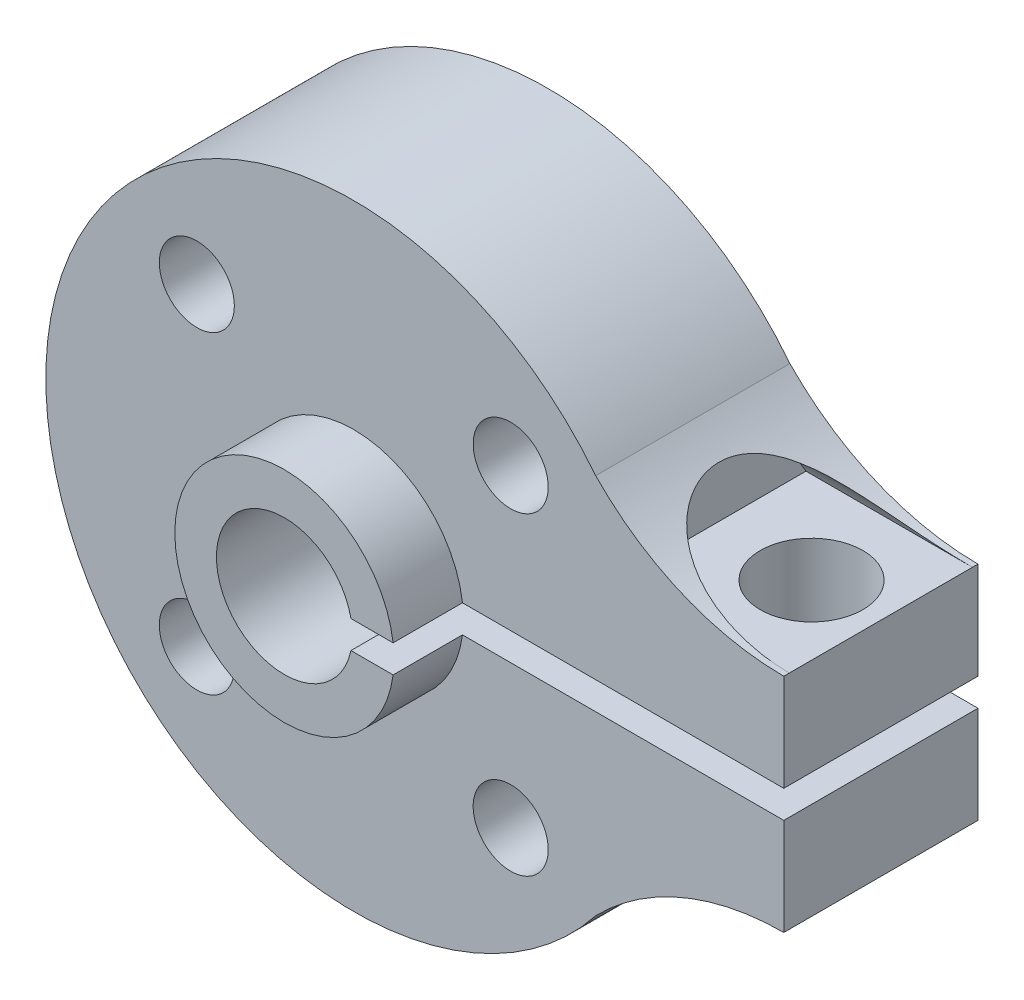
ISO-10303-21;
HEADER;
FILE_DESCRIPTION(('STEP AP214'),'2;1');
FILE_NAME('part.step','',(''),(''),'','','');
FILE_SCHEMA(('AUTOMOTIVE_DESIGN { 1 0 10303 214 1 1 1 1 }'));
ENDSEC;
DATA;
#1=APPLICATION_CONTEXT('core data for automotive mechanical design processes');
#2=APPLICATION_PROTOCOL_DEFINITION('international standard','automotive_design',2000,#1);
#3=PRODUCT_CONTEXT('',#1,'mechanical');
#4=PRODUCT('Part','Part','',(#3));
#5=PRODUCT_RELATED_PRODUCT_CATEGORY('part','',(#4));
#6=PRODUCT_DEFINITION_FORMATION('','',#4);
#7=PRODUCT_DEFINITION_CONTEXT('part definition',#1,'design');
#8=PRODUCT_DEFINITION('design','',#6,#7);
#9=PRODUCT_DEFINITION_SHAPE('','',#8);
#10=(LENGTH_UNIT() NAMED_UNIT(*) SI_UNIT(.MILLI.,.METRE.));
#11=(NAMED_UNIT(*) PLANE_ANGLE_UNIT() SI_UNIT($,.RADIAN.));
#12=(NAMED_UNIT(*) SI_UNIT($,.STERADIAN.) SOLID_ANGLE_UNIT());
#13=UNCERTAINTY_MEASURE_WITH_UNIT(LENGTH_MEASURE(1.E-05),#10,'distance_accuracy_value','');
#14=(GEOMETRIC_REPRESENTATION_CONTEXT(3) GLOBAL_UNCERTAINTY_ASSIGNED_CONTEXT((#13)) GLOBAL_UNIT_ASSIGNED_CONTEXT((#10,
#11,#12)) REPRESENTATION_CONTEXT('',''));
#15=CARTESIAN_POINT('',(0.,0.,0.));
#16=DIRECTION('',(0.,0.,1.));
#17=DIRECTION('',(1.,0.,0.));
#18=AXIS2_PLACEMENT_3D('',#15,#16,#17);
#19=CARTESIAN_POINT('',(9.5,2.30819429931814,-3.5));
#20=DIRECTION('',(-1.,0.,0.));
#21=DIRECTION('',(0.,0.,1.));
#22=AXIS2_PLACEMENT_3D('',#19,#20,#21);
#23=PLANE('',#22);
#24=CARTESIAN_POINT('',(9.5,2.30819429931814,-3.5));
#25=DIRECTION('',(1.,0.,0.));
#26=DIRECTION('',(0.,0.,-1.));
#27=AXIS2_PLACEMENT_3D('',#24,#25,#26);
#28=CIRCLE('',#27,3.70839675990308);
#29=CARTESIAN_POINT('',(9.5,4.,-6.8));
#30=VERTEX_POINT('',#29);
#31=CARTESIAN_POINT('',(9.5,4.,-0.2));
#32=VERTEX_POINT('',#31);
#33=EDGE_CURVE('E94',#30,#32,#28,.T.);
#34=ORIENTED_EDGE('',*,*,#33,.T.);
#35=DIRECTION('',(0.,0.,-1.));
#36=VECTOR('',#35,1.);
#37=CARTESIAN_POINT('',(9.5,4.,-0.2));
#38=LINE('',#37,#36);
#39=EDGE_CURVE('E91',#32,#30,#38,.T.);
#40=ORIENTED_EDGE('',*,*,#39,.T.);
#41=EDGE_LOOP('',(#34,#40));
#42=FACE_BOUND('',#41,.T.);
#43=ADVANCED_FACE('F15',(#42),#23,.F.);
#44=CARTESIAN_POINT('',(13.,11.1,-3.5));
#45=DIRECTION('',(0.,-1.,0.));
#46=DIRECTION('',(0.,0.,-1.));
#47=AXIS2_PLACEMENT_3D('',#44,#45,#46);
#48=CYLINDRICAL_SURFACE('',#47,1.85);
#49=CARTESIAN_POINT('',(13.,0.5,-3.5));
#50=DIRECTION('',(0.,-1.,0.));
#51=DIRECTION('',(0.,0.,-1.));
#52=AXIS2_PLACEMENT_3D('',#49,#50,#51);
#53=CIRCLE('',#52,1.85);
#54=CARTESIAN_POINT('',(13.,0.5,-5.35));
#55=VERTEX_POINT('',#54);
#56=EDGE_CURVE('E273',#55,#55,#53,.F.);
#57=ORIENTED_EDGE('',*,*,#56,.F.);
#58=EDGE_LOOP('',(#57));
#59=FACE_BOUND('',#58,.T.);
#60=CARTESIAN_POINT('',(13.,4.,-3.5));
#61=DIRECTION('',(0.,-1.,0.));
#62=DIRECTION('',(0.,0.,-1.));
#63=AXIS2_PLACEMENT_3D('',#60,#61,#62);
#64=CIRCLE('',#63,1.85);
#65=CARTESIAN_POINT('',(13.,4.,-5.35));
#66=VERTEX_POINT('',#65);
#67=EDGE_CURVE('E18',#66,#66,#64,.F.);
#68=ORIENTED_EDGE('',*,*,#67,.T.);
#69=EDGE_LOOP('',(#68));
#70=FACE_BOUND('',#69,.T.);
#71=ADVANCED_FACE('F205',(#59,#70),#48,.F.);
#72=CARTESIAN_POINT('',(9.5,4.,-0.2));
#73=DIRECTION('',(0.,-1.,0.));
#74=DIRECTION('',(0.,0.,-1.));
#75=AXIS2_PLACEMENT_3D('',#72,#73,#74);
#76=PLANE('',#75);
#77=ORIENTED_EDGE('',*,*,#67,.F.);
#78=EDGE_LOOP('',(#77));
#79=FACE_BOUND('',#78,.T.);
#80=ORIENTED_EDGE('',*,*,#39,.F.);
#81=DIRECTION('',(1.,0.,0.));
#82=VECTOR('',#81,1.);
#83=CARTESIAN_POINT('',(9.5,4.,-0.200000000000001));
#84=LINE('',#83,#82);
#85=CARTESIAN_POINT('',(15.5,4.,-0.2));
#86=VERTEX_POINT('',#85);
#87=EDGE_CURVE('E98',#32,#86,#84,.T.);
#88=ORIENTED_EDGE('',*,*,#87,.T.);
#89=DIRECTION('',(0.,0.,-1.));
#90=VECTOR('',#89,1.);
#91=CARTESIAN_POINT('',(15.5,4.,-7.));
#92=LINE('',#91,#90);
#93=CARTESIAN_POINT('',(15.5,4.,-6.8));
#94=VERTEX_POINT('',#93);
#95=EDGE_CURVE('E114',#94,#86,#92,.F.);
#96=ORIENTED_EDGE('',*,*,#95,.F.);
#97=DIRECTION('',(1.,0.,0.));
#98=VECTOR('',#97,1.);
#99=CARTESIAN_POINT('',(9.5,4.,-6.8));
#100=LINE('',#99,#98);
#101=EDGE_CURVE('E99',#94,#30,#100,.F.);
#102=ORIENTED_EDGE('',*,*,#101,.T.);
#103=EDGE_LOOP('',(#80,#88,#96,#102));
#104=FACE_BOUND('',#103,.T.);
#105=ADVANCED_FACE('F101',(#79,#104),#76,.F.);
#106=CARTESIAN_POINT('',(0.,0.,2.5));
#107=DIRECTION('',(0.,0.,1.));
#108=DIRECTION('',(1.,0.,0.));
#109=AXIS2_PLACEMENT_3D('',#106,#107,#108);
#110=PLANE('',#109);
#111=DIRECTION('',(1.,0.,0.));
#112=VECTOR('',#111,1.);
#113=CARTESIAN_POINT('',(0.,-0.5,2.5));
#114=LINE('',#113,#112);
#115=CARTESIAN_POINT('',(2.39843699104229,-0.5,2.5));
#116=VERTEX_POINT('',#115);
#117=CARTESIAN_POINT('',(3.91822663969301,-0.5,2.5));
#118=VERTEX_POINT('',#117);
#119=EDGE_CURVE('E120',#116,#118,#114,.T.);
#120=ORIENTED_EDGE('',*,*,#119,.F.);
#121=CARTESIAN_POINT('',(0.,0.,2.5));
#122=DIRECTION('',(0.,0.,1.));
#123=DIRECTION('',(1.,0.,0.));
#124=AXIS2_PLACEMENT_3D('',#121,#122,#123);
#125=CIRCLE('',#124,2.45);
#126=CARTESIAN_POINT('',(2.39843699104229,0.5,2.5));
#127=VERTEX_POINT('',#126);
#128=EDGE_CURVE('E108',#116,#127,#125,.F.);
#129=ORIENTED_EDGE('',*,*,#128,.T.);
#130=DIRECTION('',(1.,0.,0.));
#131=VECTOR('',#130,1.);
#132=CARTESIAN_POINT('',(0.,0.5,2.5));
#133=LINE('',#132,#131);
#134=CARTESIAN_POINT('',(3.91822663969301,0.499999999999999,2.5));
#135=VERTEX_POINT('',#134);
#136=EDGE_CURVE('E110',#135,#127,#133,.F.);
#137=ORIENTED_EDGE('',*,*,#136,.F.);
#138=CARTESIAN_POINT('',(0.,0.,2.5));
#139=DIRECTION('',(0.,0.,-1.));
#140=DIRECTION('',(-1.,0.,0.));
#141=AXIS2_PLACEMENT_3D('',#138,#139,#140);
#142=CIRCLE('',#141,3.95);
#143=EDGE_CURVE('E194',#118,#135,#142,.T.);
#144=ORIENTED_EDGE('',*,*,#143,.F.);
#145=EDGE_LOOP('',(#120,#129,#137,#144));
#146=FACE_BOUND('',#145,.T.);
#147=ADVANCED_FACE('F200',(#146),#110,.T.);
#148=CARTESIAN_POINT('',(9.5,2.30819429931814,-3.5));
#149=DIRECTION('',(1.,0.,0.));
#150=DIRECTION('',(0.,0.,-1.));
#151=AXIS2_PLACEMENT_3D('',#148,#149,#150);
#152=CYLINDRICAL_SURFACE('',#151,3.70839675990308);
#153=ORIENTED_EDGE('',*,*,#33,.F.);
#154=ORIENTED_EDGE('',*,*,#101,.F.);
#155=CARTESIAN_POINT('',(15.5,4.,-6.8));
#156=CARTESIAN_POINT('',(15.3854172561424,3.99999807144267,-6.79999040357477));
#157=CARTESIAN_POINT('',(15.2708345037204,4.00208452565123,-6.79893104370746));
#158=CARTESIAN_POINT('',(15.0418545088414,4.01042007363528,-6.79464326988381));
#159=CARTESIAN_POINT('',(14.927457277829,4.01666941510603,-6.79141472685915));
#160=CARTESIAN_POINT('',(14.6988557808845,4.03333058412202,-6.78271174393225));
#161=CARTESIAN_POINT('',(14.5846521614541,4.04374938302887,-6.7772335421817));
#162=CARTESIAN_POINT('',(14.3568466591295,4.06871528645661,-6.76388854983141));
#163=CARTESIAN_POINT('',(14.2432447653972,4.08326231636212,-6.75602180240309));
#164=CARTESIAN_POINT('',(13.9012476272513,4.13338726905936,-6.72837211210196));
#165=CARTESIAN_POINT('',(13.6740472792935,4.17527511633216,-6.70462249151998));
#166=CARTESIAN_POINT('',(13.2250868669362,4.2751032631053,-6.6443418692978));
#167=CARTESIAN_POINT('',(13.0033221022707,4.33302911979295,-6.60782235966463));
#168=CARTESIAN_POINT('',(12.6529356022981,4.43813091397701,-6.53609331014185));
#169=CARTESIAN_POINT('',(12.5218503492442,4.48063203510911,-6.50597227338733));
#170=CARTESIAN_POINT('',(12.2632290057728,4.57071030493075,-6.43877426680966));
#171=CARTESIAN_POINT('',(12.1356928962284,4.61828742625827,-6.40169733448122));
#172=CARTESIAN_POINT('',(11.8854487831583,4.71775519771825,-6.31963922664295));
#173=CARTESIAN_POINT('',(11.7627254940675,4.76963022726073,-6.27468606548902));
#174=CARTESIAN_POINT('',(11.5227135874722,4.87697578128223,-6.1756110759212));
#175=CARTESIAN_POINT('',(11.4054232772453,4.93244517278819,-6.12149212804412));
#176=CARTESIAN_POINT('',(11.1256985684173,5.071639846092,-5.97585734382104));
#177=CARTESIAN_POINT('',(10.9669053561282,5.15677415238713,-5.87851068639103));
#178=CARTESIAN_POINT('',(10.6682954041506,5.32718244619845,-5.65805983866077));
#179=CARTESIAN_POINT('',(10.5284532138078,5.41245608755683,-5.53499076935316));
#180=CARTESIAN_POINT('',(10.3029570714845,5.55700216381973,-5.29236628463612));
#181=CARTESIAN_POINT('',(10.2122236670459,5.61776209979494,-5.17843958840174));
#182=CARTESIAN_POINT('',(10.0487893069114,5.73065496290752,-4.93421505548655));
#183=CARTESIAN_POINT('',(9.9760826861075,5.78279059860416,-4.80392238142989));
#184=CARTESIAN_POINT('',(9.88271984953562,5.85123562170811,-4.5974617800788));
#185=CARTESIAN_POINT('',(9.85411340712691,5.87250463892867,-4.52642625450107));
#186=CARTESIAN_POINT('',(9.80265428832829,5.91113202664648,-4.3812899914558));
#187=CARTESIAN_POINT('',(9.77979860146107,5.92849244276424,-4.30719088150624));
#188=CARTESIAN_POINT('',(9.74015073098036,5.95881984828703,-4.15653545136116));
#189=CARTESIAN_POINT('',(9.72335620443466,5.97178853518842,-4.07998009311207));
#190=CARTESIAN_POINT('',(9.69604787686337,5.99297113329585,-3.92514115874213));
#191=CARTESIAN_POINT('',(9.68553304823361,6.00118582243503,-3.84685786755398));
#192=CARTESIAN_POINT('',(9.66571269419053,6.01668686364119,-3.63272797682053));
#193=CARTESIAN_POINT('',(9.66268060711463,6.01908388455583,-3.49585578487429));
#194=CARTESIAN_POINT('',(9.67580092483512,6.00879517138107,-3.22372435833211));
#195=CARTESIAN_POINT('',(9.69194697787806,5.99611443100812,-3.08846460468292));
#196=CARTESIAN_POINT('',(9.74140060570357,5.95784036040203,-2.83033541035476));
#197=CARTESIAN_POINT('',(9.77379479620414,5.93293564756355,-2.70718559216987));
#198=CARTESIAN_POINT('',(9.854030384613,5.87246966733322,-2.46884489684084));
#199=CARTESIAN_POINT('',(9.90187372262156,5.83690706156605,-2.35365502151121));
#200=CARTESIAN_POINT('',(10.0153708669368,5.75467131035558,-2.12530832541396));
#201=CARTESIAN_POINT('',(10.0820564209863,5.70738398145104,-2.01289063057051));
#202=CARTESIAN_POINT('',(10.2292221810183,5.6064316192375,-1.80068540326613));
#203=CARTESIAN_POINT('',(10.3097094543092,5.55276332282889,-1.7009043872791));
#204=CARTESIAN_POINT('',(10.4617575283369,5.45514545743436,-1.53638994983406));
#205=CARTESIAN_POINT('',(10.5309064551307,5.41191057285586,-1.46895760039825));
#206=CARTESIAN_POINT('',(10.6750840937525,5.32452300554102,-1.34130785397804));
#207=CARTESIAN_POINT('',(10.7501152592551,5.28036994550684,-1.28109349462556));
#208=CARTESIAN_POINT('',(10.9053325302043,5.19204954805674,-1.16745307872577));
#209=CARTESIAN_POINT('',(10.9855265073713,5.14788229613572,-1.11403777634628));
#210=CARTESIAN_POINT('',(11.1502648300482,5.06037063385561,-1.01360351201137));
#211=CARTESIAN_POINT('',(11.2348105538086,5.01702649020899,-0.966586593895371));
#212=CARTESIAN_POINT('',(11.4491601443267,4.911317642686,-0.857234031716232));
#213=CARTESIAN_POINT('',(11.5811855099708,4.84982407399195,-0.79839724994698));
#214=CARTESIAN_POINT('',(11.8517008005558,4.73158833415568,-0.69185096918447));
#215=CARTESIAN_POINT('',(11.9901938582407,4.6748485035395,-0.644146931053227));
#216=CARTESIAN_POINT('',(12.2727994055428,4.56698866176261,-0.558090419684882));
#217=CARTESIAN_POINT('',(12.4169310013095,4.51589049754442,-0.519773645044784));
#218=CARTESIAN_POINT('',(12.7092115298442,4.42029218777549,-0.451279086548752));
#219=CARTESIAN_POINT('',(12.8573601583134,4.37579154409096,-0.421100688078475));
#220=CARTESIAN_POINT('',(13.2088503671494,4.27964035910125,-0.358348077632845));
#221=CARTESIAN_POINT('',(13.4134887431049,4.23087541572759,-0.328582781999699));
#222=CARTESIAN_POINT('',(13.8267983828836,4.14695137700669,-0.279202513194161));
#223=CARTESIAN_POINT('',(14.0354716910433,4.11179937907042,-0.25959283308484));
#224=CARTESIAN_POINT('',(14.4530137871774,4.05585754801037,-0.229084764078336));
#225=CARTESIAN_POINT('',(14.6618549020662,4.0349132104665,-0.218092452133774));
#226=CARTESIAN_POINT('',(14.9758505914231,4.01396785329268,-0.207190475715983));
#227=CARTESIAN_POINT('',(15.0805924216449,4.00873126349007,-0.204487528312588));
#228=CARTESIAN_POINT('',(15.2902194458754,4.00174728093228,-0.200895003143422));
#229=CARTESIAN_POINT('',(15.3951046341522,3.99999975253345,-0.200005354882307));
#230=CARTESIAN_POINT('',(15.5,4.,-0.199999999999999));
#231=B_SPLINE_CURVE_WITH_KNOTS('',3,(#155,#156,#157,#158,#159,#160,#161,#162,#163,#164,#165,
#166,#167,#168,#169,#170,#171,#172,#173,#174,#175,#176,#177,#178,#179,#180,#181,#182,#183,#184,
#185,#186,#187,#188,#189,#190,#191,#192,#193,#194,#195,#196,#197,#198,#199,#200,#201,#202,#203,
#204,#205,#206,#207,#208,#209,#210,#211,#212,#213,#214,#215,#216,#217,#218,#219,#220,#221,#222,
#223,#224,#225,#226,#227,#228,#229,#230),.UNSPECIFIED.,.F.,.F.,(4,2,2,2,2,2,2,2,2,2,2,2,2,2,2,2,
2,2,2,2,2,2,2,2,2,2,2,2,2,2,2,2,2,2,2,2,2,4),(0.,0.34372397184354,0.687468397378405,
1.03178998346891,1.37610534654197,2.07189509147166,2.76706027899654,3.18996821448662,
3.61287387042043,4.03430477997364,4.45560349113384,5.06790502421624,5.67937592856169,
6.15105760704357,6.62259086613705,6.86072027072559,7.09872475577784,7.33663714177354,
7.57451058532365,7.98295112010661,8.39125641808701,8.77882172170534,9.16643571462257,
9.58186622266928,9.99751009479544,10.3145531519377,10.6317291690793,10.9494007936139,
11.2671736551728,11.7376814003852,12.2084194574227,12.6809208132693,13.1533864755719,
13.7899635271709,14.4268720269306,15.0567382504914,15.3713976456646,15.6860448076409),.UNSPECIFIED.);
#232=EDGE_CURVE('E106',#94,#86,#231,.T.);
#233=ORIENTED_EDGE('',*,*,#232,.T.);
#234=ORIENTED_EDGE('',*,*,#87,.F.);
#235=EDGE_LOOP('',(#153,#154,#233,#234));
#236=FACE_BOUND('',#235,.T.);
#237=ADVANCED_FACE('F104',(#236),#152,.F.);
#238=CARTESIAN_POINT('',(0.,0.,-7.));
#239=DIRECTION('',(0.,0.,1.));
#240=DIRECTION('',(1.,0.,0.));
#241=AXIS2_PLACEMENT_3D('',#238,#239,#240);
#242=CYLINDRICAL_SURFACE('',#241,2.45);
#243=DIRECTION('',(0.,0.,-1.));
#244=VECTOR('',#243,1.);
#245=CARTESIAN_POINT('',(2.39843699104229,0.5,-7.));
#246=LINE('',#245,#244);
#247=CARTESIAN_POINT('',(2.39843699104229,0.5,-7.));
#248=VERTEX_POINT('',#247);
#249=EDGE_CURVE('E119',#127,#248,#246,.T.);
#250=ORIENTED_EDGE('',*,*,#249,.F.);
#251=ORIENTED_EDGE('',*,*,#128,.F.);
#252=DIRECTION('',(0.,0.,1.));
#253=VECTOR('',#252,1.);
#254=CARTESIAN_POINT('',(2.39843699104229,-0.5,-7.));
#255=LINE('',#254,#253);
#256=CARTESIAN_POINT('',(2.39843699104229,-0.499999999999999,-7.));
#257=VERTEX_POINT('',#256);
#258=EDGE_CURVE('E264',#257,#116,#255,.T.);
#259=ORIENTED_EDGE('',*,*,#258,.F.);
#260=CARTESIAN_POINT('',(0.,0.,-7.));
#261=DIRECTION('',(0.,0.,1.));
#262=DIRECTION('',(1.,0.,0.));
#263=AXIS2_PLACEMENT_3D('',#260,#261,#262);
#264=CIRCLE('',#263,2.45);
#265=EDGE_CURVE('E235',#257,#248,#264,.F.);
#266=ORIENTED_EDGE('',*,*,#265,.T.);
#267=EDGE_LOOP('',(#250,#251,#259,#266));
#268=FACE_BOUND('',#267,.T.);
#269=ADVANCED_FACE('F199',(#268),#242,.F.);
#270=CARTESIAN_POINT('',(13.,-0.5,-3.5));
#271=DIRECTION('',(0.,1.,0.));
#272=DIRECTION('',(0.,0.,1.));
#273=AXIS2_PLACEMENT_3D('',#270,#271,#272);
#274=CYLINDRICAL_SURFACE('',#273,1.35254999999999);
#275=CARTESIAN_POINT('',(13.,-0.499999999999999,-3.5));
#276=DIRECTION('',(0.,1.,0.));
#277=DIRECTION('',(0.,0.,1.));
#278=AXIS2_PLACEMENT_3D('',#275,#276,#277);
#279=CIRCLE('',#278,1.35254999999999);
#280=CARTESIAN_POINT('',(13.,-0.499999999999999,-2.14745000000001));
#281=VERTEX_POINT('',#280);
#282=EDGE_CURVE('E261',#281,#281,#279,.F.);
#283=ORIENTED_EDGE('',*,*,#282,.F.);
#284=EDGE_LOOP('',(#283));
#285=FACE_BOUND('',#284,.T.);
#286=CARTESIAN_POINT('',(13.,-4.33677503027378,-4.85254999999999));
#287=CARTESIAN_POINT('',(13.0756244028838,-4.31602504709523,-4.85254696301458));
#288=CARTESIAN_POINT('',(13.1516051765923,-4.29619794160846,-4.84618518657547));
#289=CARTESIAN_POINT('',(13.3020765407953,-4.25889500859744,-4.82059919768668));
#290=CARTESIAN_POINT('',(13.3765641738948,-4.24142351727094,-4.80135164331774));
#291=CARTESIAN_POINT('',(13.5217637685789,-4.20913412886103,-4.75023079003071));
#292=CARTESIAN_POINT('',(13.5924733817324,-4.19431786911497,-4.71834973936002));
#293=CARTESIAN_POINT('',(13.7277596656429,-4.16745643974484,-4.64269890734088));
#294=CARTESIAN_POINT('',(13.7923392997966,-4.1554099271032,-4.59893491043957));
#295=CARTESIAN_POINT('',(13.9118574259715,-4.13424678145695,-4.50184656621174));
#296=CARTESIAN_POINT('',(13.9669860117244,-4.12506823827676,-4.44876963540917));
#297=CARTESIAN_POINT('',(14.0676498921143,-4.10907125650646,-4.33387523915693));
#298=CARTESIAN_POINT('',(14.1131851956245,-4.10225281573338,-4.27205778179183));
#299=CARTESIAN_POINT('',(14.1926395751803,-4.09080862149922,-4.14241714608313));
#300=CARTESIAN_POINT('',(14.2267166066267,-4.08615268320466,-4.07469336223897));
#301=CARTESIAN_POINT('',(14.2831141086079,-4.07865420429123,-3.93442297936375));
#302=CARTESIAN_POINT('',(14.3054349430252,-4.0758116075445,-3.86187652968406));
#303=CARTESIAN_POINT('',(14.3376050448136,-4.07176693950703,-3.71423602346031));
#304=CARTESIAN_POINT('',(14.3474884948816,-4.07056037107229,-3.63914953451878));
#305=CARTESIAN_POINT('',(14.3546041554255,-4.06968846686251,-3.48837034297547));
#306=CARTESIAN_POINT('',(14.3518363622054,-4.07002313153772,-3.4126776401966));
#307=CARTESIAN_POINT('',(14.3337300101086,-4.07225794680072,-3.2628238698283));
#308=CARTESIAN_POINT('',(14.3183897145974,-4.07415831365847,-3.18866301528333));
#309=CARTESIAN_POINT('',(14.275592583415,-4.07965302497061,-3.04398970505836));
#310=CARTESIAN_POINT('',(14.2481357416078,-4.08324737028286,-2.97347725122596));
#311=CARTESIAN_POINT('',(14.1819346991144,-4.09233643795686,-2.83811050411693));
#312=CARTESIAN_POINT('',(14.143191881575,-4.09783092746286,-2.77325551875707));
#313=CARTESIAN_POINT('',(14.055599848678,-4.11096230824967,-2.65102847349719));
#314=CARTESIAN_POINT('',(14.0067515991758,-4.11859899480871,-2.59365569931734));
#315=CARTESIAN_POINT('',(13.9004049995365,-4.13624474947462,-2.48792835988961));
#316=CARTESIAN_POINT('',(13.8429000084126,-4.14625564236738,-2.43958078263145));
#317=CARTESIAN_POINT('',(13.721005850003,-4.16879867343351,-2.35321182421282));
#318=CARTESIAN_POINT('',(13.6566138825357,-4.18133183897984,-2.31519466572012));
#319=CARTESIAN_POINT('',(13.5222945181374,-4.20906311856514,-2.25010996413787));
#320=CARTESIAN_POINT('',(13.4523209297325,-4.22428509040084,-2.2231482972393));
#321=CARTESIAN_POINT('',(13.3095095255519,-4.25715750890201,-2.18124379642085));
#322=CARTESIAN_POINT('',(13.2366767221063,-4.27480383041942,-2.16628083566389));
#323=CARTESIAN_POINT('',(13.1362754772266,-4.30042912848765,-2.15405282071968));
#324=CARTESIAN_POINT('',(13.1090319345304,-4.3075125176695,-2.15157527392268));
#325=CARTESIAN_POINT('',(13.0545182692149,-4.32194677508647,-2.14827337089699));
#326=CARTESIAN_POINT('',(13.02724814901,-4.32929762089377,-2.14744887637396));
#327=CARTESIAN_POINT('',(12.9204851487771,-4.35859541499665,-2.14745327893679));
#328=CARTESIAN_POINT('',(12.8411573985793,-4.38149358243874,-2.1544873089395));
#329=CARTESIAN_POINT('',(12.6852233828783,-4.42868477443356,-2.18219691227583));
#330=CARTESIAN_POINT('',(12.6086238047205,-4.45298088948822,-2.20290386048637));
#331=CARTESIAN_POINT('',(12.4604238136452,-4.50197644860191,-2.25723517881549));
#332=CARTESIAN_POINT('',(12.3888159156169,-4.52667521711848,-2.2908396940311));
#333=CARTESIAN_POINT('',(12.2523975563339,-4.57542712001505,-2.37008673277669));
#334=CARTESIAN_POINT('',(12.1875844716815,-4.59948050088293,-2.41572458627591));
#335=CARTESIAN_POINT('',(12.066092706108,-4.64591476415353,-2.51838022839361));
#336=CARTESIAN_POINT('',(12.009475929731,-4.66828236277703,-2.57547755939347));
#337=CARTESIAN_POINT('',(11.9067943489346,-4.70980484353352,-2.69951911881265));
#338=CARTESIAN_POINT('',(11.8607277374493,-4.72896027570589,-2.76646165768281));
#339=CARTESIAN_POINT('',(11.7828595230148,-4.76188242697211,-2.9050429611292));
#340=CARTESIAN_POINT('',(11.750484358307,-4.77586185860483,-2.97630771465424));
#341=CARTESIAN_POINT('',(11.6983800807687,-4.79857595621327,-3.1240960569208));
#342=CARTESIAN_POINT('',(11.6786422846566,-4.80731422319207,-3.20061599464913));
#343=CARTESIAN_POINT('',(11.6538330569858,-4.81833124512195,-3.35003064716998));
#344=CARTESIAN_POINT('',(11.6477021624014,-4.82107632293046,-3.42271620206813));
#345=CARTESIAN_POINT('',(11.6472133398873,-4.82129439766836,-3.56812561197517));
#346=CARTESIAN_POINT('',(11.6528522686444,-4.81876880221256,-3.64084945157383));
#347=CARTESIAN_POINT('',(11.6751488910641,-4.80886387933526,-3.78104776644719));
#348=CARTESIAN_POINT('',(11.6913298512417,-4.80169462626298,-3.84861412241824));
#349=CARTESIAN_POINT('',(11.7335930127345,-4.78320045366593,-3.97996523649169));
#350=CARTESIAN_POINT('',(11.759676513263,-4.77187498885273,-4.04374949711308));
#351=CARTESIAN_POINT('',(11.8218442232517,-4.74533254981107,-4.16807937030676));
#352=CARTESIAN_POINT('',(11.858229553766,-4.72999967809933,-4.22844909361418));
#353=CARTESIAN_POINT('',(11.9394434654755,-4.69651550044696,-4.34232201689261));
#354=CARTESIAN_POINT('',(11.9842740193636,-4.67836353617775,-4.3958236076388));
#355=CARTESIAN_POINT('',(12.0848855503532,-4.63866994229757,-4.49876050491149));
#356=CARTESIAN_POINT('',(12.141240369494,-4.61697546004347,-4.54757611986351));
#357=CARTESIAN_POINT('',(12.2609023319215,-4.5723847604621,-4.63517857764382));
#358=CARTESIAN_POINT('',(12.32421517611,-4.54948756585883,-4.67395710821763));
#359=CARTESIAN_POINT('',(12.4604063804737,-4.5020136995674,-4.74274375877201));
#360=CARTESIAN_POINT('',(12.5336359351567,-4.47742199081221,-4.7720466671701));
#361=CARTESIAN_POINT('',(12.6841928072668,-4.42903145395725,-4.81750429880625));
#362=CARTESIAN_POINT('',(12.7615110459203,-4.40523104573618,-4.83368694878717));
#363=CARTESIAN_POINT('',(12.8663091631003,-4.37447621185725,-4.84619256481914));
#364=CARTESIAN_POINT('',(12.8929448670467,-4.36678698824123,-4.84857208497996));
#365=CARTESIAN_POINT('',(12.9463720796099,-4.35161810246073,-4.85175140794023));
#366=CARTESIAN_POINT('',(12.973163601156,-4.34413845799489,-4.85255107771762));
#367=CARTESIAN_POINT('',(13.,-4.33677503027378,-4.85254999999999));
#368=B_SPLINE_CURVE_WITH_KNOTS('',3,(#286,#287,#288,#289,#290,#291,#292,#293,#294,#295,#296,
#297,#298,#299,#300,#301,#302,#303,#304,#305,#306,#307,#308,#309,#310,#311,#312,#313,#314,#315,
#316,#317,#318,#319,#320,#321,#322,#323,#324,#325,#326,#327,#328,#329,#330,#331,#332,#333,#334,
#335,#336,#337,#338,#339,#340,#341,#342,#343,#344,#345,#346,#347,#348,#349,#350,#351,#352,#353,
#354,#355,#356,#357,#358,#359,#360,#361,#362,#363,#364,#365,#366,#367),.UNSPECIFIED.,.T.,.F.,(4,
2,2,2,2,2,2,2,2,2,2,2,2,2,2,2,2,2,2,2,2,2,2,2,2,2,2,2,2,2,2,2,2,2,2,2,2,2,2,2,4),(0.,
0.235156125095202,0.47073938008275,0.706467410339804,0.9420808966722,1.17218628652237,
1.40229146353742,1.62908035860401,1.85586223359727,2.08201945408251,2.30817674063826,
2.53436527146954,2.76055391684524,2.98671485344268,3.21285418404323,3.43916788907326,
3.66557396353494,3.89410030788412,4.12224251159395,4.20697910212449,4.2917086032957,
4.53896406557837,4.78678887924426,5.03423370431231,5.2815826392477,5.53071185711653,
5.7797983713707,6.01705550167896,6.25414943443388,6.47201834782337,6.68982908339601,
6.8984160033134,7.10703029929505,7.32251633600993,7.53805276997815,7.76999873519806,
8.00213617726567,8.24887725823781,8.49509175661004,8.57853323887223,8.66198174653674),.UNSPECIFIED.);
#369=CARTESIAN_POINT('',(13.,-4.33677503027378,-4.85254999999999));
#370=VERTEX_POINT('',#369);
#371=EDGE_CURVE('E150',#370,#370,#368,.T.);
#372=ORIENTED_EDGE('',*,*,#371,.T.);
#373=EDGE_LOOP('',(#372));
#374=FACE_BOUND('',#373,.T.);
#375=ADVANCED_FACE('F160',(#285,#374),#274,.F.);
#376=CARTESIAN_POINT('',(0.,0.5,-7.));
#377=DIRECTION('',(0.,-1.,0.));
#378=DIRECTION('',(0.,0.,-1.));
#379=AXIS2_PLACEMENT_3D('',#376,#377,#378);
#380=PLANE('',#379);
#381=ORIENTED_EDGE('',*,*,#56,.T.);
#382=EDGE_LOOP('',(#381));
#383=FACE_BOUND('',#382,.T.);
#384=ORIENTED_EDGE('',*,*,#136,.T.);
#385=ORIENTED_EDGE('',*,*,#249,.T.);
#386=DIRECTION('',(1.,0.,0.));
#387=VECTOR('',#386,1.);
#388=CARTESIAN_POINT('',(15.5,0.5,-7.));
#389=LINE('',#388,#387);
#390=CARTESIAN_POINT('',(15.5,0.5,-7.));
#391=VERTEX_POINT('',#390);
#392=EDGE_CURVE('E245',#248,#391,#389,.T.);
#393=ORIENTED_EDGE('',*,*,#392,.T.);
#394=DIRECTION('',(0.,0.,-1.));
#395=VECTOR('',#394,1.);
#396=CARTESIAN_POINT('',(15.5,0.5,-7.));
#397=LINE('',#396,#395);
#398=CARTESIAN_POINT('',(15.5,0.5,0.));
#399=VERTEX_POINT('',#398);
#400=EDGE_CURVE('E270',#399,#391,#397,.T.);
#401=ORIENTED_EDGE('',*,*,#400,.F.);
#402=DIRECTION('',(1.,0.,0.));
#403=VECTOR('',#402,1.);
#404=CARTESIAN_POINT('',(15.5,0.5,0.));
#405=LINE('',#404,#403);
#406=CARTESIAN_POINT('',(3.91822663969301,0.5,0.));
#407=VERTEX_POINT('',#406);
#408=EDGE_CURVE('E157',#407,#399,#405,.T.);
#409=ORIENTED_EDGE('',*,*,#408,.F.);
#410=DIRECTION('',(0.,0.,-1.));
#411=VECTOR('',#410,1.);
#412=CARTESIAN_POINT('',(3.91822663969301,0.499999999999999,2.5));
#413=LINE('',#412,#411);
#414=EDGE_CURVE('E191',#135,#407,#413,.T.);
#415=ORIENTED_EDGE('',*,*,#414,.F.);
#416=EDGE_LOOP('',(#384,#385,#393,#401,#409,#415));
#417=FACE_BOUND('',#416,.T.);
#418=ADVANCED_FACE('F291',(#383,#417),#380,.T.);
#419=CARTESIAN_POINT('',(15.5,0.5,-7.));
#420=DIRECTION('',(1.,0.,0.));
#421=DIRECTION('',(0.,0.,-1.));
#422=AXIS2_PLACEMENT_3D('',#419,#420,#421);
#423=PLANE('',#422);
#424=DIRECTION('',(0.,0.,1.));
#425=VECTOR('',#424,1.);
#426=CARTESIAN_POINT('',(15.5,4.,-7.));
#427=LINE('',#426,#425);
#428=CARTESIAN_POINT('',(15.5,4.,0.));
#429=VERTEX_POINT('',#428);
#430=EDGE_CURVE('E190',#86,#429,#427,.T.);
#431=ORIENTED_EDGE('',*,*,#430,.T.);
#432=DIRECTION('',(0.,1.,0.));
#433=VECTOR('',#432,1.);
#434=CARTESIAN_POINT('',(15.5,-13.4475790200994,0.));
#435=LINE('',#434,#433);
#436=EDGE_CURVE('E149',#399,#429,#435,.T.);
#437=ORIENTED_EDGE('',*,*,#436,.F.);
#438=ORIENTED_EDGE('',*,*,#400,.T.);
#439=DIRECTION('',(0.,1.,0.));
#440=VECTOR('',#439,1.);
#441=CARTESIAN_POINT('',(15.5,-13.4475790200994,-7.));
#442=LINE('',#441,#440);
#443=CARTESIAN_POINT('',(15.5,4.,-7.));
#444=VERTEX_POINT('',#443);
#445=EDGE_CURVE('E243',#391,#444,#442,.T.);
#446=ORIENTED_EDGE('',*,*,#445,.T.);
#447=DIRECTION('',(0.,0.,1.));
#448=VECTOR('',#447,1.);
#449=CARTESIAN_POINT('',(15.5,4.,-7.));
#450=LINE('',#449,#448);
#451=EDGE_CURVE('E250',#444,#94,#450,.T.);
#452=ORIENTED_EDGE('',*,*,#451,.T.);
#453=ORIENTED_EDGE('',*,*,#95,.T.);
#454=EDGE_LOOP('',(#431,#437,#438,#446,#452,#453));
#455=FACE_BOUND('',#454,.T.);
#456=ADVANCED_FACE('F336',(#455),#423,.T.);
#457=CARTESIAN_POINT('',(15.5,-0.5,-7.));
#458=DIRECTION('',(1.,0.,0.));
#459=DIRECTION('',(0.,0.,-1.));
#460=AXIS2_PLACEMENT_3D('',#457,#458,#459);
#461=PLANE('',#460);
#462=DIRECTION('',(0.,0.,1.));
#463=VECTOR('',#462,1.);
#464=CARTESIAN_POINT('',(15.5,-0.5,-7.));
#465=LINE('',#464,#463);
#466=CARTESIAN_POINT('',(15.5,-0.499999999999999,0.));
#467=VERTEX_POINT('',#466);
#468=CARTESIAN_POINT('',(15.5,-0.499999999999999,-7.));
#469=VERTEX_POINT('',#468);
#470=EDGE_CURVE('E122',#467,#469,#465,.F.);
#471=ORIENTED_EDGE('',*,*,#470,.F.);
#472=DIRECTION('',(0.,1.,0.));
#473=VECTOR('',#472,1.);
#474=CARTESIAN_POINT('',(15.5,-13.4475790200994,0.));
#475=LINE('',#474,#473);
#476=CARTESIAN_POINT('',(15.5,-4.,0.));
#477=VERTEX_POINT('',#476);
#478=EDGE_CURVE('E145',#477,#467,#475,.T.);
#479=ORIENTED_EDGE('',*,*,#478,.F.);
#480=DIRECTION('',(0.,0.,1.));
#481=VECTOR('',#480,1.);
#482=CARTESIAN_POINT('',(15.5,-4.,-7.));
#483=LINE('',#482,#481);
#484=CARTESIAN_POINT('',(15.5,-4.,-7.));
#485=VERTEX_POINT('',#484);
#486=EDGE_CURVE('E267',#477,#485,#483,.F.);
#487=ORIENTED_EDGE('',*,*,#486,.T.);
#488=DIRECTION('',(0.,1.,0.));
#489=VECTOR('',#488,1.);
#490=CARTESIAN_POINT('',(15.5,-13.4475790200994,-7.));
#491=LINE('',#490,#489);
#492=EDGE_CURVE('E236',#485,#469,#491,.T.);
#493=ORIENTED_EDGE('',*,*,#492,.T.);
#494=EDGE_LOOP('',(#471,#479,#487,#493));
#495=FACE_BOUND('',#494,.T.);
#496=ADVANCED_FACE('F301',(#495),#461,.T.);
#497=CARTESIAN_POINT('',(0.,-0.5,-7.));
#498=DIRECTION('',(0.,1.,0.));
#499=DIRECTION('',(0.,0.,1.));
#500=AXIS2_PLACEMENT_3D('',#497,#498,#499);
#501=PLANE('',#500);
#502=ORIENTED_EDGE('',*,*,#282,.T.);
#503=EDGE_LOOP('',(#502));
#504=FACE_BOUND('',#503,.T.);
#505=DIRECTION('',(1.,0.,0.));
#506=VECTOR('',#505,1.);
#507=CARTESIAN_POINT('',(15.5,-0.499999999999999,-7.));
#508=LINE('',#507,#506);
#509=EDGE_CURVE('E232',#469,#257,#508,.F.);
#510=ORIENTED_EDGE('',*,*,#509,.T.);
#511=ORIENTED_EDGE('',*,*,#258,.T.);
#512=ORIENTED_EDGE('',*,*,#119,.T.);
#513=DIRECTION('',(0.,0.,-1.));
#514=VECTOR('',#513,1.);
#515=CARTESIAN_POINT('',(3.91822663969301,-0.499999999999999,2.5));
#516=LINE('',#515,#514);
#517=CARTESIAN_POINT('',(3.91822663969301,-0.499999999999999,0.));
#518=VERTEX_POINT('',#517);
#519=EDGE_CURVE('E258',#518,#118,#516,.F.);
#520=ORIENTED_EDGE('',*,*,#519,.F.);
#521=DIRECTION('',(1.,0.,0.));
#522=VECTOR('',#521,1.);
#523=CARTESIAN_POINT('',(15.5,-0.499999999999999,0.));
#524=LINE('',#523,#522);
#525=EDGE_CURVE('E143',#467,#518,#524,.F.);
#526=ORIENTED_EDGE('',*,*,#525,.F.);
#527=ORIENTED_EDGE('',*,*,#470,.T.);
#528=EDGE_LOOP('',(#510,#511,#512,#520,#526,#527));
#529=FACE_BOUND('',#528,.T.);
#530=ADVANCED_FACE('F286',(#504,#529),#501,.T.);
#531=CARTESIAN_POINT('',(0.,0.,2.5));
#532=DIRECTION('',(0.,0.,-1.));
#533=DIRECTION('',(-1.,0.,0.));
#534=AXIS2_PLACEMENT_3D('',#531,#532,#533);
#535=CYLINDRICAL_SURFACE('',#534,3.95);
#536=CARTESIAN_POINT('',(0.,0.,0.));
#537=DIRECTION('',(0.,0.,-1.));
#538=DIRECTION('',(-1.,0.,0.));
#539=AXIS2_PLACEMENT_3D('',#536,#537,#538);
#540=CIRCLE('',#539,3.95);
#541=EDGE_CURVE('E140',#518,#407,#540,.T.);
#542=ORIENTED_EDGE('',*,*,#541,.F.);
#543=ORIENTED_EDGE('',*,*,#519,.T.);
#544=ORIENTED_EDGE('',*,*,#143,.T.);
#545=ORIENTED_EDGE('',*,*,#414,.T.);
#546=EDGE_LOOP('',(#542,#543,#544,#545));
#547=FACE_BOUND('',#546,.T.);
#548=ADVANCED_FACE('F328',(#547),#535,.T.);
#549=CARTESIAN_POINT('',(-5.65651622481619,5.65719225397115,0.));
#550=DIRECTION('',(0.,0.,1.));
#551=DIRECTION('',(1.,0.,0.));
#552=AXIS2_PLACEMENT_3D('',#549,#550,#551);
#553=CYLINDRICAL_SURFACE('',#552,1.35254999999999);
#554=CARTESIAN_POINT('',(-5.65651622481619,5.65719225397115,0.));
#555=DIRECTION('',(0.,0.,1.));
#556=DIRECTION('',(1.,0.,0.));
#557=AXIS2_PLACEMENT_3D('',#554,#555,#556);
#558=CIRCLE('',#557,1.35254999999999);
#559=CARTESIAN_POINT('',(-4.3039662248162,5.65719225397115,0.));
#560=VERTEX_POINT('',#559);
#561=EDGE_CURVE('E137',#560,#560,#558,.F.);
#562=ORIENTED_EDGE('',*,*,#561,.F.);
#563=EDGE_LOOP('',(#562));
#564=FACE_BOUND('',#563,.T.);
#565=CARTESIAN_POINT('',(-5.65651622481619,5.65719225397115,-7.));
#566=DIRECTION('',(0.,0.,1.));
#567=DIRECTION('',(1.,0.,0.));
#568=AXIS2_PLACEMENT_3D('',#565,#566,#567);
#569=CIRCLE('',#568,1.35254999999999);
#570=CARTESIAN_POINT('',(-4.3039662248162,5.65719225397115,-7.));
#571=VERTEX_POINT('',#570);
#572=EDGE_CURVE('E332',#571,#571,#569,.F.);
#573=ORIENTED_EDGE('',*,*,#572,.T.);
#574=EDGE_LOOP('',(#573));
#575=FACE_BOUND('',#574,.T.);
#576=ADVANCED_FACE('F352',(#564,#575),#553,.F.);
#577=CARTESIAN_POINT('',(5.65719225397115,5.65651622481619,0.));
#578=DIRECTION('',(0.,0.,1.));
#579=DIRECTION('',(1.,0.,0.));
#580=AXIS2_PLACEMENT_3D('',#577,#578,#579);
#581=CYLINDRICAL_SURFACE('',#580,1.35254999999999);
#582=CARTESIAN_POINT('',(5.65719225397115,5.65651622481619,0.));
#583=DIRECTION('',(0.,0.,1.));
#584=DIRECTION('',(1.,0.,0.));
#585=AXIS2_PLACEMENT_3D('',#582,#583,#584);
#586=CIRCLE('',#585,1.35254999999999);
#587=CARTESIAN_POINT('',(7.00974225397114,5.65651622481619,0.));
#588=VERTEX_POINT('',#587);
#589=EDGE_CURVE('E134',#588,#588,#586,.F.);
#590=ORIENTED_EDGE('',*,*,#589,.F.);
#591=EDGE_LOOP('',(#590));
#592=FACE_BOUND('',#591,.T.);
#593=CARTESIAN_POINT('',(5.65719225397115,5.65651622481619,-7.));
#594=DIRECTION('',(0.,0.,1.));
#595=DIRECTION('',(1.,0.,0.));
#596=AXIS2_PLACEMENT_3D('',#593,#594,#595);
#597=CIRCLE('',#596,1.35254999999999);
#598=CARTESIAN_POINT('',(7.00974225397114,5.65651622481619,-7.));
#599=VERTEX_POINT('',#598);
#600=EDGE_CURVE('E372',#599,#599,#597,.F.);
#601=ORIENTED_EDGE('',*,*,#600,.T.);
#602=EDGE_LOOP('',(#601));
#603=FACE_BOUND('',#602,.T.);
#604=ADVANCED_FACE('F355',(#592,#603),#581,.F.);
#605=CARTESIAN_POINT('',(5.65651622481619,-5.65719225397115,0.));
#606=DIRECTION('',(0.,0.,1.));
#607=DIRECTION('',(1.,0.,0.));
#608=AXIS2_PLACEMENT_3D('',#605,#606,#607);
#609=CYLINDRICAL_SURFACE('',#608,1.35254999999999);
#610=CARTESIAN_POINT('',(5.65651622481619,-5.65719225397115,0.));
#611=DIRECTION('',(0.,0.,1.));
#612=DIRECTION('',(1.,0.,0.));
#613=AXIS2_PLACEMENT_3D('',#610,#611,#612);
#614=CIRCLE('',#613,1.35254999999999);
#615=CARTESIAN_POINT('',(7.00906622481618,-5.65719225397115,0.));
#616=VERTEX_POINT('',#615);
#617=EDGE_CURVE('E131',#616,#616,#614,.F.);
#618=ORIENTED_EDGE('',*,*,#617,.F.);
#619=EDGE_LOOP('',(#618));
#620=FACE_BOUND('',#619,.T.);
#621=CARTESIAN_POINT('',(5.65651622481619,-5.65719225397115,-7.));
#622=DIRECTION('',(0.,0.,1.));
#623=DIRECTION('',(1.,0.,0.));
#624=AXIS2_PLACEMENT_3D('',#621,#622,#623);
#625=CIRCLE('',#624,1.35254999999999);
#626=CARTESIAN_POINT('',(7.00906622481618,-5.65719225397115,-7.));
#627=VERTEX_POINT('',#626);
#628=EDGE_CURVE('E370',#627,#627,#625,.F.);
#629=ORIENTED_EDGE('',*,*,#628,.T.);
#630=EDGE_LOOP('',(#629));
#631=FACE_BOUND('',#630,.T.);
#632=ADVANCED_FACE('F358',(#620,#631),#609,.F.);
#633=CARTESIAN_POINT('',(-5.65719225397115,-5.65651622481619,0.));
#634=DIRECTION('',(0.,0.,1.));
#635=DIRECTION('',(1.,0.,0.));
#636=AXIS2_PLACEMENT_3D('',#633,#634,#635);
#637=CYLINDRICAL_SURFACE('',#636,1.35254999999999);
#638=CARTESIAN_POINT('',(-5.65719225397115,-5.65651622481619,0.));
#639=DIRECTION('',(0.,0.,1.));
#640=DIRECTION('',(1.,0.,0.));
#641=AXIS2_PLACEMENT_3D('',#638,#639,#640);
#642=CIRCLE('',#641,1.35254999999999);
#643=CARTESIAN_POINT('',(-4.30464225397116,-5.65651622481619,0.));
#644=VERTEX_POINT('',#643);
#645=EDGE_CURVE('E128',#644,#644,#642,.F.);
#646=ORIENTED_EDGE('',*,*,#645,.F.);
#647=EDGE_LOOP('',(#646));
#648=FACE_BOUND('',#647,.T.);
#649=CARTESIAN_POINT('',(-5.65719225397115,-5.65651622481619,-7.));
#650=DIRECTION('',(0.,0.,1.));
#651=DIRECTION('',(1.,0.,0.));
#652=AXIS2_PLACEMENT_3D('',#649,#650,#651);
#653=CIRCLE('',#652,1.35254999999999);
#654=CARTESIAN_POINT('',(-4.30464225397116,-5.65651622481619,-7.));
#655=VERTEX_POINT('',#654);
#656=EDGE_CURVE('E269',#655,#655,#653,.F.);
#657=ORIENTED_EDGE('',*,*,#656,.T.);
#658=EDGE_LOOP('',(#657));
#659=FACE_BOUND('',#658,.T.);
#660=ADVANCED_FACE('F180',(#648,#659),#637,.F.);
#661=CARTESIAN_POINT('',(15.5,13.4475790200994,-7.));
#662=DIRECTION('',(0.,0.,1.));
#663=DIRECTION('',(1.,0.,0.));
#664=AXIS2_PLACEMENT_3D('',#661,#662,#663);
#665=CYLINDRICAL_SURFACE('',#664,9.44757902009939);
#666=CARTESIAN_POINT('',(15.5,13.4475790200994,-7.));
#667=DIRECTION('',(0.,0.,1.));
#668=DIRECTION('',(1.,0.,0.));
#669=AXIS2_PLACEMENT_3D('',#666,#667,#668);
#670=CIRCLE('',#669,9.44757902009939);
#671=CARTESIAN_POINT('',(8.7198645412164,6.86833039266727,-7.));
#672=VERTEX_POINT('',#671);
#673=EDGE_CURVE('E192',#444,#672,#670,.F.);
#674=ORIENTED_EDGE('',*,*,#673,.T.);
#675=DIRECTION('',(0.,0.,1.));
#676=VECTOR('',#675,1.);
#677=CARTESIAN_POINT('',(8.71986454121639,6.86833039266728,-7.));
#678=LINE('',#677,#676);
#679=CARTESIAN_POINT('',(8.7198645412164,6.86833039266727,0.));
#680=VERTEX_POINT('',#679);
#681=EDGE_CURVE('E127',#680,#672,#678,.F.);
#682=ORIENTED_EDGE('',*,*,#681,.F.);
#683=CARTESIAN_POINT('',(15.5,13.4475790200994,0.));
#684=DIRECTION('',(0.,0.,1.));
#685=DIRECTION('',(1.,0.,0.));
#686=AXIS2_PLACEMENT_3D('',#683,#684,#685);
#687=CIRCLE('',#686,9.44757902009939);
#688=EDGE_CURVE('E146',#429,#680,#687,.F.);
#689=ORIENTED_EDGE('',*,*,#688,.F.);
#690=ORIENTED_EDGE('',*,*,#430,.F.);
#691=ORIENTED_EDGE('',*,*,#232,.F.);
#692=ORIENTED_EDGE('',*,*,#451,.F.);
#693=EDGE_LOOP('',(#674,#682,#689,#690,#691,#692));
#694=FACE_BOUND('',#693,.T.);
#695=ADVANCED_FACE('F175',(#694),#665,.F.);
#696=CARTESIAN_POINT('',(15.5,-13.4475790200994,-7.));
#697=DIRECTION('',(0.,0.,1.));
#698=DIRECTION('',(1.,0.,0.));
#699=AXIS2_PLACEMENT_3D('',#696,#697,#698);
#700=PLANE('',#699);
#701=ORIENTED_EDGE('',*,*,#656,.F.);
#702=EDGE_LOOP('',(#701));
#703=FACE_BOUND('',#702,.T.);
#704=ORIENTED_EDGE('',*,*,#628,.F.);
#705=EDGE_LOOP('',(#704));
#706=FACE_BOUND('',#705,.T.);
#707=ORIENTED_EDGE('',*,*,#600,.F.);
#708=EDGE_LOOP('',(#707));
#709=FACE_BOUND('',#708,.T.);
#710=ORIENTED_EDGE('',*,*,#572,.F.);
#711=EDGE_LOOP('',(#710));
#712=FACE_BOUND('',#711,.T.);
#713=ORIENTED_EDGE('',*,*,#509,.F.);
#714=ORIENTED_EDGE('',*,*,#492,.F.);
#715=CARTESIAN_POINT('',(15.5,-13.4475790200994,-7.));
#716=DIRECTION('',(0.,0.,1.));
#717=DIRECTION('',(1.,0.,0.));
#718=AXIS2_PLACEMENT_3D('',#715,#716,#717);
#719=CIRCLE('',#718,9.44757902009939);
#720=CARTESIAN_POINT('',(8.7198645412164,-6.86833039266727,-7.));
#721=VERTEX_POINT('',#720);
#722=EDGE_CURVE('E158',#485,#721,#719,.T.);
#723=ORIENTED_EDGE('',*,*,#722,.T.);
#724=CARTESIAN_POINT('',(0.,0.,-7.));
#725=DIRECTION('',(0.,0.,1.));
#726=DIRECTION('',(1.,0.,0.));
#727=AXIS2_PLACEMENT_3D('',#724,#725,#726);
#728=CIRCLE('',#727,11.1);
#729=EDGE_CURVE('E124',#672,#721,#728,.T.);
#730=ORIENTED_EDGE('',*,*,#729,.F.);
#731=ORIENTED_EDGE('',*,*,#673,.F.);
#732=ORIENTED_EDGE('',*,*,#445,.F.);
#733=ORIENTED_EDGE('',*,*,#392,.F.);
#734=ORIENTED_EDGE('',*,*,#265,.F.);
#735=EDGE_LOOP('',(#713,#714,#723,#730,#731,#732,#733,#734));
#736=FACE_BOUND('',#735,.T.);
#737=ADVANCED_FACE('F170',(#703,#706,#709,#712,#736),#700,.F.);
#738=CARTESIAN_POINT('',(15.5,-13.4475790200994,-7.));
#739=DIRECTION('',(0.,0.,1.));
#740=DIRECTION('',(1.,0.,0.));
#741=AXIS2_PLACEMENT_3D('',#738,#739,#740);
#742=CYLINDRICAL_SURFACE('',#741,9.44757902009939);
#743=ORIENTED_EDGE('',*,*,#371,.F.);
#744=EDGE_LOOP('',(#743));
#745=FACE_BOUND('',#744,.T.);
#746=ORIENTED_EDGE('',*,*,#722,.F.);
#747=ORIENTED_EDGE('',*,*,#486,.F.);
#748=CARTESIAN_POINT('',(15.5,-13.4475790200994,0.));
#749=DIRECTION('',(0.,0.,1.));
#750=DIRECTION('',(1.,0.,0.));
#751=AXIS2_PLACEMENT_3D('',#748,#749,#750);
#752=CIRCLE('',#751,9.44757902009939);
#753=CARTESIAN_POINT('',(8.7198645412164,-6.86833039266727,0.));
#754=VERTEX_POINT('',#753);
#755=EDGE_CURVE('E33',#754,#477,#752,.F.);
#756=ORIENTED_EDGE('',*,*,#755,.F.);
#757=DIRECTION('',(0.,0.,1.));
#758=VECTOR('',#757,1.);
#759=CARTESIAN_POINT('',(8.71986454121639,-6.86833039266728,-7.));
#760=LINE('',#759,#758);
#761=EDGE_CURVE('E24',#721,#754,#760,.T.);
#762=ORIENTED_EDGE('',*,*,#761,.F.);
#763=EDGE_LOOP('',(#746,#747,#756,#762));
#764=FACE_BOUND('',#763,.T.);
#765=ADVANCED_FACE('F164',(#745,#764),#742,.F.);
#766=CARTESIAN_POINT('',(15.5,-13.4475790200994,0.));
#767=DIRECTION('',(0.,0.,1.));
#768=DIRECTION('',(1.,0.,0.));
#769=AXIS2_PLACEMENT_3D('',#766,#767,#768);
#770=PLANE('',#769);
#771=ORIENTED_EDGE('',*,*,#645,.T.);
#772=EDGE_LOOP('',(#771));
#773=FACE_BOUND('',#772,.T.);
#774=ORIENTED_EDGE('',*,*,#617,.T.);
#775=EDGE_LOOP('',(#774));
#776=FACE_BOUND('',#775,.T.);
#777=ORIENTED_EDGE('',*,*,#589,.T.);
#778=EDGE_LOOP('',(#777));
#779=FACE_BOUND('',#778,.T.);
#780=ORIENTED_EDGE('',*,*,#561,.T.);
#781=EDGE_LOOP('',(#780));
#782=FACE_BOUND('',#781,.T.);
#783=ORIENTED_EDGE('',*,*,#525,.T.);
#784=ORIENTED_EDGE('',*,*,#541,.T.);
#785=ORIENTED_EDGE('',*,*,#408,.T.);
#786=ORIENTED_EDGE('',*,*,#436,.T.);
#787=ORIENTED_EDGE('',*,*,#688,.T.);
#788=CARTESIAN_POINT('',(0.,0.,0.));
#789=DIRECTION('',(0.,0.,1.));
#790=DIRECTION('',(1.,0.,0.));
#791=AXIS2_PLACEMENT_3D('',#788,#789,#790);
#792=CIRCLE('',#791,11.1);
#793=EDGE_CURVE('E10',#754,#680,#792,.F.);
#794=ORIENTED_EDGE('',*,*,#793,.F.);
#795=ORIENTED_EDGE('',*,*,#755,.T.);
#796=ORIENTED_EDGE('',*,*,#478,.T.);
#797=EDGE_LOOP('',(#783,#784,#785,#786,#787,#794,#795,#796));
#798=FACE_BOUND('',#797,.T.);
#799=ADVANCED_FACE('F169',(#773,#776,#779,#782,#798),#770,.T.);
#800=CARTESIAN_POINT('',(0.,0.,-7.));
#801=DIRECTION('',(0.,0.,1.));
#802=DIRECTION('',(1.,0.,0.));
#803=AXIS2_PLACEMENT_3D('',#800,#801,#802);
#804=CYLINDRICAL_SURFACE('',#803,11.1);
#805=ORIENTED_EDGE('',*,*,#761,.T.);
#806=ORIENTED_EDGE('',*,*,#793,.T.);
#807=ORIENTED_EDGE('',*,*,#681,.T.);
#808=ORIENTED_EDGE('',*,*,#729,.T.);
#809=EDGE_LOOP('',(#805,#806,#807,#808));
#810=FACE_BOUND('',#809,.T.);
#811=ADVANCED_FACE('F215',(#810),#804,.T.);
#812=CLOSED_SHELL('',(#43,#71,#105,#147,#237,#269,#375,#418,#456,#496,#530,#548,#576,#604,#632,
#660,#695,#737,#765,#799,#811));
#813=MANIFOLD_SOLID_BREP('B1',#812);
#814=ADVANCED_BREP_SHAPE_REPRESENTATION('',(#18,#813),#14);
#815=SHAPE_DEFINITION_REPRESENTATION(#9,#814);
ENDSEC;
END-ISO-10303-21;
